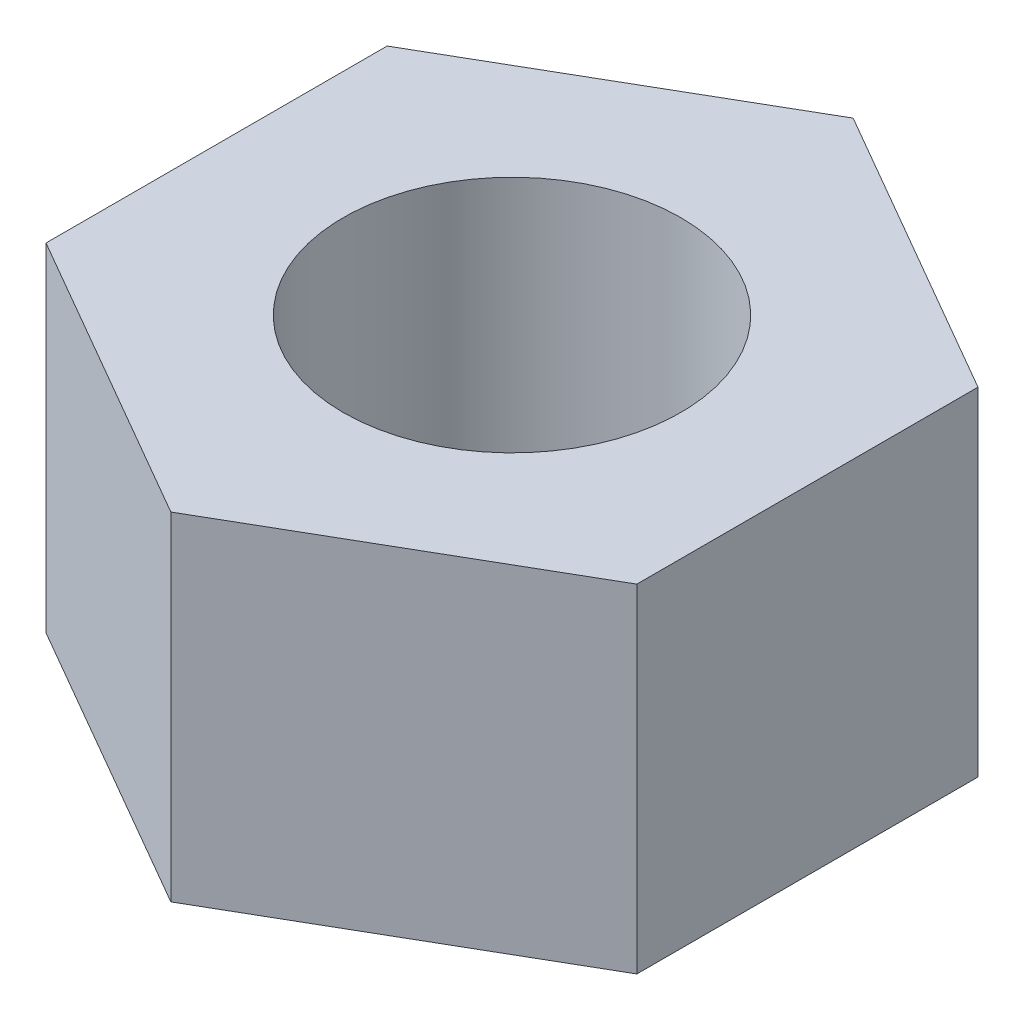
ISO-10303-21;
HEADER;
FILE_DESCRIPTION(('STEP AP214'),'2;1');
FILE_NAME('part.step','',(''),(''),'','','');
FILE_SCHEMA(('AUTOMOTIVE_DESIGN { 1 0 10303 214 1 1 1 1 }'));
ENDSEC;
DATA;
#1=APPLICATION_CONTEXT('core data for automotive mechanical design processes');
#2=APPLICATION_PROTOCOL_DEFINITION('international standard','automotive_design',2000,#1);
#3=PRODUCT_CONTEXT('',#1,'mechanical');
#4=PRODUCT('Part','Part','',(#3));
#5=PRODUCT_RELATED_PRODUCT_CATEGORY('part','',(#4));
#6=PRODUCT_DEFINITION_FORMATION('','',#4);
#7=PRODUCT_DEFINITION_CONTEXT('part definition',#1,'design');
#8=PRODUCT_DEFINITION('design','',#6,#7);
#9=PRODUCT_DEFINITION_SHAPE('','',#8);
#10=(LENGTH_UNIT() NAMED_UNIT(*) SI_UNIT(.MILLI.,.METRE.));
#11=(NAMED_UNIT(*) PLANE_ANGLE_UNIT() SI_UNIT($,.RADIAN.));
#12=(NAMED_UNIT(*) SI_UNIT($,.STERADIAN.) SOLID_ANGLE_UNIT());
#13=UNCERTAINTY_MEASURE_WITH_UNIT(LENGTH_MEASURE(1.E-05),#10,'distance_accuracy_value','');
#14=(GEOMETRIC_REPRESENTATION_CONTEXT(3) GLOBAL_UNCERTAINTY_ASSIGNED_CONTEXT((#13)) GLOBAL_UNIT_ASSIGNED_CONTEXT((#10,
#11,#12)) REPRESENTATION_CONTEXT('',''));
#15=CARTESIAN_POINT('',(0.,0.,0.));
#16=DIRECTION('',(0.,0.,1.));
#17=DIRECTION('',(1.,0.,0.));
#18=AXIS2_PLACEMENT_3D('',#15,#16,#17);
#19=CARTESIAN_POINT('',(0.,4.,0.));
#20=DIRECTION('',(0.,1.,0.));
#21=DIRECTION('',(0.,0.,1.));
#22=AXIS2_PLACEMENT_3D('',#19,#20,#21);
#23=PLANE('',#22);
#24=DIRECTION('',(0.866025403784439,0.,0.5));
#25=VECTOR('',#24,1.);
#26=CARTESIAN_POINT('',(-3.5,4.,2.02072594216369));
#27=LINE('',#26,#25);
#28=CARTESIAN_POINT('',(-3.5,4.,2.02072594216369));
#29=VERTEX_POINT('',#28);
#30=CARTESIAN_POINT('',(0.,4.,4.04145188432738));
#31=VERTEX_POINT('',#30);
#32=EDGE_CURVE('E133',#29,#31,#27,.T.);
#33=ORIENTED_EDGE('',*,*,#32,.T.);
#34=DIRECTION('',(0.866025403784439,0.,-0.5));
#35=VECTOR('',#34,1.);
#36=CARTESIAN_POINT('',(0.,4.,4.04145188432738));
#37=LINE('',#36,#35);
#38=CARTESIAN_POINT('',(3.5,4.,2.02072594216369));
#39=VERTEX_POINT('',#38);
#40=EDGE_CURVE('E91',#31,#39,#37,.T.);
#41=ORIENTED_EDGE('',*,*,#40,.T.);
#42=DIRECTION('',(0.,0.,-1.));
#43=VECTOR('',#42,1.);
#44=CARTESIAN_POINT('',(3.5,4.,2.02072594216369));
#45=LINE('',#44,#43);
#46=CARTESIAN_POINT('',(3.5,4.,-2.02072594216369));
#47=VERTEX_POINT('',#46);
#48=EDGE_CURVE('E104',#39,#47,#45,.T.);
#49=ORIENTED_EDGE('',*,*,#48,.T.);
#50=DIRECTION('',(-0.866025403784439,0.,-0.5));
#51=VECTOR('',#50,1.);
#52=CARTESIAN_POINT('',(3.5,4.,-2.02072594216369));
#53=LINE('',#52,#51);
#54=CARTESIAN_POINT('',(0.,4.,-4.04145188432738));
#55=VERTEX_POINT('',#54);
#56=EDGE_CURVE('E98',#47,#55,#53,.T.);
#57=ORIENTED_EDGE('',*,*,#56,.T.);
#58=DIRECTION('',(-0.866025403784439,0.,0.5));
#59=VECTOR('',#58,1.);
#60=CARTESIAN_POINT('',(0.,4.,-4.04145188432738));
#61=LINE('',#60,#59);
#62=CARTESIAN_POINT('',(-3.5,4.,-2.02072594216369));
#63=VERTEX_POINT('',#62);
#64=EDGE_CURVE('E102',#55,#63,#61,.T.);
#65=ORIENTED_EDGE('',*,*,#64,.T.);
#66=DIRECTION('',(0.,0.,1.));
#67=VECTOR('',#66,1.);
#68=CARTESIAN_POINT('',(-3.5,4.,-2.02072594216369));
#69=LINE('',#68,#67);
#70=EDGE_CURVE('E54',#63,#29,#69,.T.);
#71=ORIENTED_EDGE('',*,*,#70,.T.);
#72=EDGE_LOOP('',(#33,#41,#49,#57,#65,#71));
#73=FACE_BOUND('',#72,.T.);
#74=CARTESIAN_POINT('',(0.,4.,0.));
#75=DIRECTION('',(0.,1.,0.));
#76=DIRECTION('',(0.,0.,1.));
#77=AXIS2_PLACEMENT_3D('',#74,#75,#76);
#78=CIRCLE('',#77,2.);
#79=CARTESIAN_POINT('',(0.,4.,2.));
#80=VERTEX_POINT('',#79);
#81=EDGE_CURVE('E126',#80,#80,#78,.T.);
#82=ORIENTED_EDGE('',*,*,#81,.F.);
#83=EDGE_LOOP('',(#82));
#84=FACE_BOUND('',#83,.T.);
#85=ADVANCED_FACE('F37',(#73,#84),#23,.T.);
#86=CARTESIAN_POINT('',(0.,0.,0.));
#87=DIRECTION('',(0.,1.,0.));
#88=DIRECTION('',(0.,0.,1.));
#89=AXIS2_PLACEMENT_3D('',#86,#87,#88);
#90=PLANE('',#89);
#91=DIRECTION('',(0.866025403784439,0.,0.5));
#92=VECTOR('',#91,1.);
#93=CARTESIAN_POINT('',(-3.5,0.,2.02072594216369));
#94=LINE('',#93,#92);
#95=CARTESIAN_POINT('',(-3.5,0.,2.02072594216369));
#96=VERTEX_POINT('',#95);
#97=CARTESIAN_POINT('',(0.,0.,4.04145188432738));
#98=VERTEX_POINT('',#97);
#99=EDGE_CURVE('E122',#96,#98,#94,.T.);
#100=ORIENTED_EDGE('',*,*,#99,.F.);
#101=DIRECTION('',(0.,0.,1.));
#102=VECTOR('',#101,1.);
#103=CARTESIAN_POINT('',(-3.5,0.,-2.02072594216369));
#104=LINE('',#103,#102);
#105=CARTESIAN_POINT('',(-3.5,0.,-2.02072594216369));
#106=VERTEX_POINT('',#105);
#107=EDGE_CURVE('E83',#106,#96,#104,.T.);
#108=ORIENTED_EDGE('',*,*,#107,.F.);
#109=DIRECTION('',(-0.866025403784439,0.,0.5));
#110=VECTOR('',#109,1.);
#111=CARTESIAN_POINT('',(0.,0.,-4.04145188432738));
#112=LINE('',#111,#110);
#113=CARTESIAN_POINT('',(0.,0.,-4.04145188432738));
#114=VERTEX_POINT('',#113);
#115=EDGE_CURVE('E77',#114,#106,#112,.T.);
#116=ORIENTED_EDGE('',*,*,#115,.F.);
#117=DIRECTION('',(-0.866025403784439,0.,-0.5));
#118=VECTOR('',#117,1.);
#119=CARTESIAN_POINT('',(3.5,0.,-2.02072594216369));
#120=LINE('',#119,#118);
#121=CARTESIAN_POINT('',(3.5,0.,-2.02072594216369));
#122=VERTEX_POINT('',#121);
#123=EDGE_CURVE('E112',#122,#114,#120,.T.);
#124=ORIENTED_EDGE('',*,*,#123,.F.);
#125=DIRECTION('',(0.,0.,-1.));
#126=VECTOR('',#125,1.);
#127=CARTESIAN_POINT('',(3.5,0.,2.02072594216369));
#128=LINE('',#127,#126);
#129=CARTESIAN_POINT('',(3.5,0.,2.02072594216369));
#130=VERTEX_POINT('',#129);
#131=EDGE_CURVE('E128',#130,#122,#128,.T.);
#132=ORIENTED_EDGE('',*,*,#131,.F.);
#133=DIRECTION('',(0.866025403784439,0.,-0.5));
#134=VECTOR('',#133,1.);
#135=CARTESIAN_POINT('',(0.,0.,4.04145188432738));
#136=LINE('',#135,#134);
#137=EDGE_CURVE('E125',#98,#130,#136,.T.);
#138=ORIENTED_EDGE('',*,*,#137,.F.);
#139=EDGE_LOOP('',(#100,#108,#116,#124,#132,#138));
#140=FACE_BOUND('',#139,.T.);
#141=CARTESIAN_POINT('',(0.,0.,0.));
#142=DIRECTION('',(0.,1.,0.));
#143=DIRECTION('',(0.,0.,1.));
#144=AXIS2_PLACEMENT_3D('',#141,#142,#143);
#145=CIRCLE('',#144,2.);
#146=CARTESIAN_POINT('',(0.,0.,2.));
#147=VERTEX_POINT('',#146);
#148=EDGE_CURVE('E244',#147,#147,#145,.T.);
#149=ORIENTED_EDGE('',*,*,#148,.T.);
#150=EDGE_LOOP('',(#149));
#151=FACE_BOUND('',#150,.T.);
#152=ADVANCED_FACE('F142',(#140,#151),#90,.F.);
#153=CARTESIAN_POINT('',(-3.5,4.,2.02072594216369));
#154=DIRECTION('',(0.5,0.,-0.866025403784439));
#155=DIRECTION('',(-0.866025403784439,0.,-0.5));
#156=AXIS2_PLACEMENT_3D('',#153,#154,#155);
#157=PLANE('',#156);
#158=ORIENTED_EDGE('',*,*,#99,.T.);
#159=DIRECTION('',(0.,-1.,0.));
#160=VECTOR('',#159,1.);
#161=CARTESIAN_POINT('',(0.,4.,4.04145188432738));
#162=LINE('',#161,#160);
#163=EDGE_CURVE('E11',#31,#98,#162,.T.);
#164=ORIENTED_EDGE('',*,*,#163,.F.);
#165=ORIENTED_EDGE('',*,*,#32,.F.);
#166=DIRECTION('',(0.,-1.,0.));
#167=VECTOR('',#166,1.);
#168=CARTESIAN_POINT('',(-3.5,4.,2.02072594216369));
#169=LINE('',#168,#167);
#170=EDGE_CURVE('E118',#29,#96,#169,.T.);
#171=ORIENTED_EDGE('',*,*,#170,.T.);
#172=EDGE_LOOP('',(#158,#164,#165,#171));
#173=FACE_BOUND('',#172,.T.);
#174=ADVANCED_FACE('F39',(#173),#157,.F.);
#175=CARTESIAN_POINT('',(0.,4.,4.04145188432738));
#176=DIRECTION('',(-0.5,0.,-0.866025403784439));
#177=DIRECTION('',(-0.866025403784439,0.,0.5));
#178=AXIS2_PLACEMENT_3D('',#175,#176,#177);
#179=PLANE('',#178);
#180=ORIENTED_EDGE('',*,*,#137,.T.);
#181=DIRECTION('',(0.,-1.,0.));
#182=VECTOR('',#181,1.);
#183=CARTESIAN_POINT('',(3.5,4.,2.02072594216369));
#184=LINE('',#183,#182);
#185=EDGE_CURVE('E46',#39,#130,#184,.T.);
#186=ORIENTED_EDGE('',*,*,#185,.F.);
#187=ORIENTED_EDGE('',*,*,#40,.F.);
#188=ORIENTED_EDGE('',*,*,#163,.T.);
#189=EDGE_LOOP('',(#180,#186,#187,#188));
#190=FACE_BOUND('',#189,.T.);
#191=ADVANCED_FACE('F167',(#190),#179,.F.);
#192=CARTESIAN_POINT('',(3.5,4.,2.02072594216369));
#193=DIRECTION('',(-1.,0.,0.));
#194=DIRECTION('',(0.,0.,1.));
#195=AXIS2_PLACEMENT_3D('',#192,#193,#194);
#196=PLANE('',#195);
#197=ORIENTED_EDGE('',*,*,#131,.T.);
#198=DIRECTION('',(0.,-1.,0.));
#199=VECTOR('',#198,1.);
#200=CARTESIAN_POINT('',(3.5,4.,-2.02072594216369));
#201=LINE('',#200,#199);
#202=EDGE_CURVE('E113',#47,#122,#201,.T.);
#203=ORIENTED_EDGE('',*,*,#202,.F.);
#204=ORIENTED_EDGE('',*,*,#48,.F.);
#205=ORIENTED_EDGE('',*,*,#185,.T.);
#206=EDGE_LOOP('',(#197,#203,#204,#205));
#207=FACE_BOUND('',#206,.T.);
#208=ADVANCED_FACE('F139',(#207),#196,.F.);
#209=CARTESIAN_POINT('',(3.5,4.,-2.02072594216369));
#210=DIRECTION('',(-0.5,0.,0.866025403784439));
#211=DIRECTION('',(0.866025403784439,0.,0.5));
#212=AXIS2_PLACEMENT_3D('',#209,#210,#211);
#213=PLANE('',#212);
#214=ORIENTED_EDGE('',*,*,#123,.T.);
#215=DIRECTION('',(0.,-1.,0.));
#216=VECTOR('',#215,1.);
#217=CARTESIAN_POINT('',(0.,4.,-4.04145188432738));
#218=LINE('',#217,#216);
#219=EDGE_CURVE('E109',#55,#114,#218,.T.);
#220=ORIENTED_EDGE('',*,*,#219,.F.);
#221=ORIENTED_EDGE('',*,*,#56,.F.);
#222=ORIENTED_EDGE('',*,*,#202,.T.);
#223=EDGE_LOOP('',(#214,#220,#221,#222));
#224=FACE_BOUND('',#223,.T.);
#225=ADVANCED_FACE('F110',(#224),#213,.F.);
#226=CARTESIAN_POINT('',(0.,4.,-4.04145188432738));
#227=DIRECTION('',(0.5,0.,0.866025403784439));
#228=DIRECTION('',(0.866025403784439,0.,-0.5));
#229=AXIS2_PLACEMENT_3D('',#226,#227,#228);
#230=PLANE('',#229);
#231=ORIENTED_EDGE('',*,*,#115,.T.);
#232=DIRECTION('',(0.,-1.,0.));
#233=VECTOR('',#232,1.);
#234=CARTESIAN_POINT('',(-3.5,4.,-2.02072594216369));
#235=LINE('',#234,#233);
#236=EDGE_CURVE('E114',#63,#106,#235,.T.);
#237=ORIENTED_EDGE('',*,*,#236,.F.);
#238=ORIENTED_EDGE('',*,*,#64,.F.);
#239=ORIENTED_EDGE('',*,*,#219,.T.);
#240=EDGE_LOOP('',(#231,#237,#238,#239));
#241=FACE_BOUND('',#240,.T.);
#242=ADVANCED_FACE('F116',(#241),#230,.F.);
#243=CARTESIAN_POINT('',(-3.5,4.,-2.02072594216369));
#244=DIRECTION('',(1.,0.,0.));
#245=DIRECTION('',(0.,0.,-1.));
#246=AXIS2_PLACEMENT_3D('',#243,#244,#245);
#247=PLANE('',#246);
#248=ORIENTED_EDGE('',*,*,#107,.T.);
#249=ORIENTED_EDGE('',*,*,#170,.F.);
#250=ORIENTED_EDGE('',*,*,#70,.F.);
#251=ORIENTED_EDGE('',*,*,#236,.T.);
#252=EDGE_LOOP('',(#248,#249,#250,#251));
#253=FACE_BOUND('',#252,.T.);
#254=ADVANCED_FACE('F147',(#253),#247,.F.);
#255=CARTESIAN_POINT('',(0.,4.,0.));
#256=DIRECTION('',(0.,-1.,0.));
#257=DIRECTION('',(0.,0.,-1.));
#258=AXIS2_PLACEMENT_3D('',#255,#256,#257);
#259=CYLINDRICAL_SURFACE('',#258,2.);
#260=ORIENTED_EDGE('',*,*,#81,.T.);
#261=EDGE_LOOP('',(#260));
#262=FACE_BOUND('',#261,.T.);
#263=ORIENTED_EDGE('',*,*,#148,.F.);
#264=EDGE_LOOP('',(#263));
#265=FACE_BOUND('',#264,.T.);
#266=ADVANCED_FACE('F149',(#262,#265),#259,.F.);
#267=CLOSED_SHELL('',(#85,#152,#174,#191,#208,#225,#242,#254,#266));
#268=MANIFOLD_SOLID_BREP('B2',#267);
#269=ADVANCED_BREP_SHAPE_REPRESENTATION('',(#18,#268),#14);
#270=SHAPE_DEFINITION_REPRESENTATION(#9,#269);
ENDSEC;
END-ISO-10303-21;
